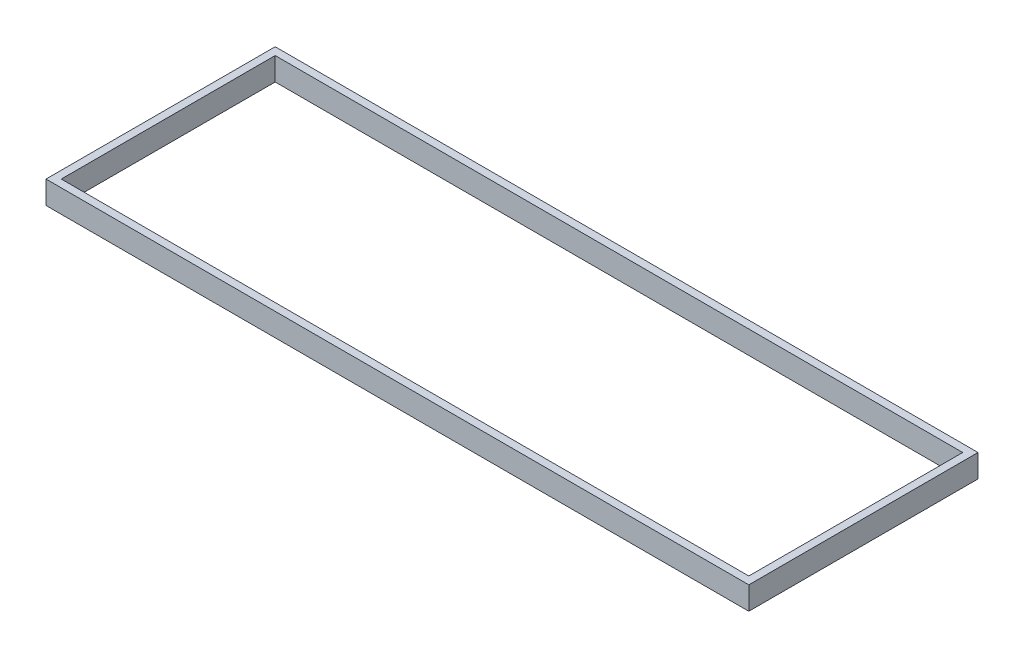
ISO-10303-21;
HEADER;
FILE_DESCRIPTION(('STEP AP214'),'2;1');
FILE_NAME('part.step','',(''),(''),'','','');
FILE_SCHEMA(('AUTOMOTIVE_DESIGN { 1 0 10303 214 1 1 1 1 }'));
ENDSEC;
DATA;
#1=APPLICATION_CONTEXT('core data for automotive mechanical design processes');
#2=APPLICATION_PROTOCOL_DEFINITION('international standard','automotive_design',2000,#1);
#3=PRODUCT_CONTEXT('',#1,'mechanical');
#4=PRODUCT('Part','Part','',(#3));
#5=PRODUCT_RELATED_PRODUCT_CATEGORY('part','',(#4));
#6=PRODUCT_DEFINITION_FORMATION('','',#4);
#7=PRODUCT_DEFINITION_CONTEXT('part definition',#1,'design');
#8=PRODUCT_DEFINITION('design','',#6,#7);
#9=PRODUCT_DEFINITION_SHAPE('','',#8);
#10=(LENGTH_UNIT() NAMED_UNIT(*) SI_UNIT(.MILLI.,.METRE.));
#11=(NAMED_UNIT(*) PLANE_ANGLE_UNIT() SI_UNIT($,.RADIAN.));
#12=(NAMED_UNIT(*) SI_UNIT($,.STERADIAN.) SOLID_ANGLE_UNIT());
#13=UNCERTAINTY_MEASURE_WITH_UNIT(LENGTH_MEASURE(1.E-05),#10,'distance_accuracy_value','');
#14=(GEOMETRIC_REPRESENTATION_CONTEXT(3) GLOBAL_UNCERTAINTY_ASSIGNED_CONTEXT((#13)) GLOBAL_UNIT_ASSIGNED_CONTEXT((#10,
#11,#12)) REPRESENTATION_CONTEXT('',''));
#15=CARTESIAN_POINT('',(0.,0.,0.));
#16=DIRECTION('',(0.,0.,1.));
#17=DIRECTION('',(1.,0.,0.));
#18=AXIS2_PLACEMENT_3D('',#15,#16,#17);
#19=CARTESIAN_POINT('',(0.,3.,0.));
#20=DIRECTION('',(0.,1.,0.));
#21=DIRECTION('',(0.,0.,1.));
#22=AXIS2_PLACEMENT_3D('',#19,#20,#21);
#23=PLANE('',#22);
#24=DIRECTION('',(0.,0.,-1.));
#25=VECTOR('',#24,1.);
#26=CARTESIAN_POINT('',(46.,3.,-14.));
#27=LINE('',#26,#25);
#28=CARTESIAN_POINT('',(46.,3.,15.));
#29=VERTEX_POINT('',#28);
#30=CARTESIAN_POINT('',(46.,3.,-15.));
#31=VERTEX_POINT('',#30);
#32=EDGE_CURVE('E177',#29,#31,#27,.T.);
#33=ORIENTED_EDGE('',*,*,#32,.T.);
#34=DIRECTION('',(-1.,0.,0.));
#35=VECTOR('',#34,1.);
#36=CARTESIAN_POINT('',(-45.,3.,-15.));
#37=LINE('',#36,#35);
#38=CARTESIAN_POINT('',(-46.,3.,-15.));
#39=VERTEX_POINT('',#38);
#40=EDGE_CURVE('E181',#31,#39,#37,.T.);
#41=ORIENTED_EDGE('',*,*,#40,.T.);
#42=DIRECTION('',(0.,0.,1.));
#43=VECTOR('',#42,1.);
#44=CARTESIAN_POINT('',(-46.,3.,-14.));
#45=LINE('',#44,#43);
#46=CARTESIAN_POINT('',(-46.,3.,15.));
#47=VERTEX_POINT('',#46);
#48=EDGE_CURVE('E185',#39,#47,#45,.T.);
#49=ORIENTED_EDGE('',*,*,#48,.T.);
#50=DIRECTION('',(1.,0.,0.));
#51=VECTOR('',#50,1.);
#52=CARTESIAN_POINT('',(-45.,3.,15.));
#53=LINE('',#52,#51);
#54=EDGE_CURVE('E188',#47,#29,#53,.T.);
#55=ORIENTED_EDGE('',*,*,#54,.T.);
#56=EDGE_LOOP('',(#33,#41,#49,#55));
#57=FACE_BOUND('',#56,.T.);
#58=DIRECTION('',(-1.,0.,0.));
#59=VECTOR('',#58,1.);
#60=CARTESIAN_POINT('',(-45.,3.,-14.));
#61=LINE('',#60,#59);
#62=CARTESIAN_POINT('',(45.,3.,-14.));
#63=VERTEX_POINT('',#62);
#64=CARTESIAN_POINT('',(-45.,3.,-14.));
#65=VERTEX_POINT('',#64);
#66=EDGE_CURVE('E138',#63,#65,#61,.T.);
#67=ORIENTED_EDGE('',*,*,#66,.F.);
#68=DIRECTION('',(0.,0.,-1.));
#69=VECTOR('',#68,1.);
#70=CARTESIAN_POINT('',(45.,3.,-14.));
#71=LINE('',#70,#69);
#72=CARTESIAN_POINT('',(45.,3.,14.));
#73=VERTEX_POINT('',#72);
#74=EDGE_CURVE('E129',#73,#63,#71,.T.);
#75=ORIENTED_EDGE('',*,*,#74,.F.);
#76=DIRECTION('',(1.,0.,0.));
#77=VECTOR('',#76,1.);
#78=CARTESIAN_POINT('',(-45.,3.,14.));
#79=LINE('',#78,#77);
#80=CARTESIAN_POINT('',(-45.,3.,14.));
#81=VERTEX_POINT('',#80);
#82=EDGE_CURVE('E155',#81,#73,#79,.T.);
#83=ORIENTED_EDGE('',*,*,#82,.F.);
#84=DIRECTION('',(0.,0.,1.));
#85=VECTOR('',#84,1.);
#86=CARTESIAN_POINT('',(-45.,3.,-14.));
#87=LINE('',#86,#85);
#88=EDGE_CURVE('E151',#65,#81,#87,.T.);
#89=ORIENTED_EDGE('',*,*,#88,.F.);
#90=EDGE_LOOP('',(#67,#75,#83,#89));
#91=FACE_BOUND('',#90,.T.);
#92=ADVANCED_FACE('F63',(#57,#91),#23,.T.);
#93=CARTESIAN_POINT('',(0.,0.,0.));
#94=DIRECTION('',(0.,1.,0.));
#95=DIRECTION('',(0.,0.,1.));
#96=AXIS2_PLACEMENT_3D('',#93,#94,#95);
#97=PLANE('',#96);
#98=DIRECTION('',(0.,0.,-1.));
#99=VECTOR('',#98,1.);
#100=CARTESIAN_POINT('',(46.,0.,-14.));
#101=LINE('',#100,#99);
#102=CARTESIAN_POINT('',(46.,0.,15.));
#103=VERTEX_POINT('',#102);
#104=CARTESIAN_POINT('',(46.,0.,-15.));
#105=VERTEX_POINT('',#104);
#106=EDGE_CURVE('E147',#103,#105,#101,.T.);
#107=ORIENTED_EDGE('',*,*,#106,.F.);
#108=DIRECTION('',(1.,0.,0.));
#109=VECTOR('',#108,1.);
#110=CARTESIAN_POINT('',(-45.,0.,15.));
#111=LINE('',#110,#109);
#112=CARTESIAN_POINT('',(-46.,0.,15.));
#113=VERTEX_POINT('',#112);
#114=EDGE_CURVE('E182',#113,#103,#111,.T.);
#115=ORIENTED_EDGE('',*,*,#114,.F.);
#116=DIRECTION('',(0.,0.,1.));
#117=VECTOR('',#116,1.);
#118=CARTESIAN_POINT('',(-46.,0.,-14.));
#119=LINE('',#118,#117);
#120=CARTESIAN_POINT('',(-46.,0.,-15.));
#121=VERTEX_POINT('',#120);
#122=EDGE_CURVE('E198',#121,#113,#119,.T.);
#123=ORIENTED_EDGE('',*,*,#122,.F.);
#124=DIRECTION('',(-1.,0.,0.));
#125=VECTOR('',#124,1.);
#126=CARTESIAN_POINT('',(-45.,0.,-15.));
#127=LINE('',#126,#125);
#128=EDGE_CURVE('E195',#105,#121,#127,.T.);
#129=ORIENTED_EDGE('',*,*,#128,.F.);
#130=EDGE_LOOP('',(#107,#115,#123,#129));
#131=FACE_BOUND('',#130,.T.);
#132=DIRECTION('',(0.,0.,-1.));
#133=VECTOR('',#132,1.);
#134=CARTESIAN_POINT('',(45.,0.,-14.));
#135=LINE('',#134,#133);
#136=CARTESIAN_POINT('',(45.,0.,14.));
#137=VERTEX_POINT('',#136);
#138=CARTESIAN_POINT('',(45.,0.,-14.));
#139=VERTEX_POINT('',#138);
#140=EDGE_CURVE('E87',#137,#139,#135,.T.);
#141=ORIENTED_EDGE('',*,*,#140,.T.);
#142=DIRECTION('',(-1.,0.,0.));
#143=VECTOR('',#142,1.);
#144=CARTESIAN_POINT('',(-45.,0.,-14.));
#145=LINE('',#144,#143);
#146=CARTESIAN_POINT('',(-45.,0.,-14.));
#147=VERTEX_POINT('',#146);
#148=EDGE_CURVE('E145',#139,#147,#145,.T.);
#149=ORIENTED_EDGE('',*,*,#148,.T.);
#150=DIRECTION('',(0.,0.,1.));
#151=VECTOR('',#150,1.);
#152=CARTESIAN_POINT('',(-45.,0.,-14.));
#153=LINE('',#152,#151);
#154=CARTESIAN_POINT('',(-45.,0.,14.));
#155=VERTEX_POINT('',#154);
#156=EDGE_CURVE('E164',#147,#155,#153,.T.);
#157=ORIENTED_EDGE('',*,*,#156,.T.);
#158=DIRECTION('',(1.,0.,0.));
#159=VECTOR('',#158,1.);
#160=CARTESIAN_POINT('',(-45.,0.,14.));
#161=LINE('',#160,#159);
#162=EDGE_CURVE('E139',#155,#137,#161,.T.);
#163=ORIENTED_EDGE('',*,*,#162,.T.);
#164=EDGE_LOOP('',(#141,#149,#157,#163));
#165=FACE_BOUND('',#164,.T.);
#166=ADVANCED_FACE('F221',(#131,#165),#97,.F.);
#167=CARTESIAN_POINT('',(46.,3.,-14.));
#168=DIRECTION('',(-1.,0.,0.));
#169=DIRECTION('',(0.,0.,1.));
#170=AXIS2_PLACEMENT_3D('',#167,#168,#169);
#171=PLANE('',#170);
#172=ORIENTED_EDGE('',*,*,#106,.T.);
#173=DIRECTION('',(0.,-1.,0.));
#174=VECTOR('',#173,1.);
#175=CARTESIAN_POINT('',(46.,3.,-15.));
#176=LINE('',#175,#174);
#177=EDGE_CURVE('E12',#31,#105,#176,.T.);
#178=ORIENTED_EDGE('',*,*,#177,.F.);
#179=ORIENTED_EDGE('',*,*,#32,.F.);
#180=DIRECTION('',(0.,-1.,0.));
#181=VECTOR('',#180,1.);
#182=CARTESIAN_POINT('',(46.,3.,15.));
#183=LINE('',#182,#181);
#184=EDGE_CURVE('E191',#29,#103,#183,.T.);
#185=ORIENTED_EDGE('',*,*,#184,.T.);
#186=EDGE_LOOP('',(#172,#178,#179,#185));
#187=FACE_BOUND('',#186,.T.);
#188=ADVANCED_FACE('F65',(#187),#171,.F.);
#189=CARTESIAN_POINT('',(-45.,3.,-15.));
#190=DIRECTION('',(0.,0.,1.));
#191=DIRECTION('',(1.,0.,0.));
#192=AXIS2_PLACEMENT_3D('',#189,#190,#191);
#193=PLANE('',#192);
#194=ORIENTED_EDGE('',*,*,#128,.T.);
#195=DIRECTION('',(0.,-1.,0.));
#196=VECTOR('',#195,1.);
#197=CARTESIAN_POINT('',(-46.,3.,-15.));
#198=LINE('',#197,#196);
#199=EDGE_CURVE('E72',#39,#121,#198,.T.);
#200=ORIENTED_EDGE('',*,*,#199,.F.);
#201=ORIENTED_EDGE('',*,*,#40,.F.);
#202=ORIENTED_EDGE('',*,*,#177,.T.);
#203=EDGE_LOOP('',(#194,#200,#201,#202));
#204=FACE_BOUND('',#203,.T.);
#205=ADVANCED_FACE('F231',(#204),#193,.F.);
#206=CARTESIAN_POINT('',(-46.,3.,-14.));
#207=DIRECTION('',(1.,0.,0.));
#208=DIRECTION('',(0.,0.,-1.));
#209=AXIS2_PLACEMENT_3D('',#206,#207,#208);
#210=PLANE('',#209);
#211=ORIENTED_EDGE('',*,*,#122,.T.);
#212=DIRECTION('',(0.,-1.,0.));
#213=VECTOR('',#212,1.);
#214=CARTESIAN_POINT('',(-46.,3.,15.));
#215=LINE('',#214,#213);
#216=EDGE_CURVE('E206',#47,#113,#215,.T.);
#217=ORIENTED_EDGE('',*,*,#216,.F.);
#218=ORIENTED_EDGE('',*,*,#48,.F.);
#219=ORIENTED_EDGE('',*,*,#199,.T.);
#220=EDGE_LOOP('',(#211,#217,#218,#219));
#221=FACE_BOUND('',#220,.T.);
#222=ADVANCED_FACE('F215',(#221),#210,.F.);
#223=CARTESIAN_POINT('',(-45.,3.,15.));
#224=DIRECTION('',(0.,0.,-1.));
#225=DIRECTION('',(-1.,0.,0.));
#226=AXIS2_PLACEMENT_3D('',#223,#224,#225);
#227=PLANE('',#226);
#228=ORIENTED_EDGE('',*,*,#114,.T.);
#229=ORIENTED_EDGE('',*,*,#184,.F.);
#230=ORIENTED_EDGE('',*,*,#54,.F.);
#231=ORIENTED_EDGE('',*,*,#216,.T.);
#232=EDGE_LOOP('',(#228,#229,#230,#231));
#233=FACE_BOUND('',#232,.T.);
#234=ADVANCED_FACE('F225',(#233),#227,.F.);
#235=CARTESIAN_POINT('',(45.,3.,-14.));
#236=DIRECTION('',(-1.,0.,0.));
#237=DIRECTION('',(0.,0.,1.));
#238=AXIS2_PLACEMENT_3D('',#235,#236,#237);
#239=PLANE('',#238);
#240=ORIENTED_EDGE('',*,*,#140,.F.);
#241=DIRECTION('',(0.,-1.,0.));
#242=VECTOR('',#241,1.);
#243=CARTESIAN_POINT('',(45.,3.,14.));
#244=LINE('',#243,#242);
#245=EDGE_CURVE('E133',#73,#137,#244,.T.);
#246=ORIENTED_EDGE('',*,*,#245,.F.);
#247=ORIENTED_EDGE('',*,*,#74,.T.);
#248=DIRECTION('',(0.,-1.,0.));
#249=VECTOR('',#248,1.);
#250=CARTESIAN_POINT('',(45.,3.,-14.));
#251=LINE('',#250,#249);
#252=EDGE_CURVE('E132',#63,#139,#251,.T.);
#253=ORIENTED_EDGE('',*,*,#252,.T.);
#254=EDGE_LOOP('',(#240,#246,#247,#253));
#255=FACE_BOUND('',#254,.T.);
#256=ADVANCED_FACE('F131',(#255),#239,.T.);
#257=CARTESIAN_POINT('',(-45.,3.,-14.));
#258=DIRECTION('',(0.,0.,1.));
#259=DIRECTION('',(1.,0.,0.));
#260=AXIS2_PLACEMENT_3D('',#257,#258,#259);
#261=PLANE('',#260);
#262=ORIENTED_EDGE('',*,*,#148,.F.);
#263=ORIENTED_EDGE('',*,*,#252,.F.);
#264=ORIENTED_EDGE('',*,*,#66,.T.);
#265=DIRECTION('',(0.,-1.,0.));
#266=VECTOR('',#265,1.);
#267=CARTESIAN_POINT('',(-45.,3.,-14.));
#268=LINE('',#267,#266);
#269=EDGE_CURVE('E148',#65,#147,#268,.T.);
#270=ORIENTED_EDGE('',*,*,#269,.T.);
#271=EDGE_LOOP('',(#262,#263,#264,#270));
#272=FACE_BOUND('',#271,.T.);
#273=ADVANCED_FACE('F142',(#272),#261,.T.);
#274=CARTESIAN_POINT('',(-45.,3.,-14.));
#275=DIRECTION('',(1.,0.,0.));
#276=DIRECTION('',(0.,0.,-1.));
#277=AXIS2_PLACEMENT_3D('',#274,#275,#276);
#278=PLANE('',#277);
#279=ORIENTED_EDGE('',*,*,#156,.F.);
#280=ORIENTED_EDGE('',*,*,#269,.F.);
#281=ORIENTED_EDGE('',*,*,#88,.T.);
#282=DIRECTION('',(0.,-1.,0.));
#283=VECTOR('',#282,1.);
#284=CARTESIAN_POINT('',(-45.,3.,14.));
#285=LINE('',#284,#283);
#286=EDGE_CURVE('E79',#81,#155,#285,.T.);
#287=ORIENTED_EDGE('',*,*,#286,.T.);
#288=EDGE_LOOP('',(#279,#280,#281,#287));
#289=FACE_BOUND('',#288,.T.);
#290=ADVANCED_FACE('F254',(#289),#278,.T.);
#291=CARTESIAN_POINT('',(-45.,3.,14.));
#292=DIRECTION('',(0.,0.,-1.));
#293=DIRECTION('',(-1.,0.,0.));
#294=AXIS2_PLACEMENT_3D('',#291,#292,#293);
#295=PLANE('',#294);
#296=ORIENTED_EDGE('',*,*,#162,.F.);
#297=ORIENTED_EDGE('',*,*,#286,.F.);
#298=ORIENTED_EDGE('',*,*,#82,.T.);
#299=ORIENTED_EDGE('',*,*,#245,.T.);
#300=EDGE_LOOP('',(#296,#297,#298,#299));
#301=FACE_BOUND('',#300,.T.);
#302=ADVANCED_FACE('F258',(#301),#295,.T.);
#303=CLOSED_SHELL('',(#92,#166,#188,#205,#222,#234,#256,#273,#290,#302));
#304=MANIFOLD_SOLID_BREP('B2',#303);
#305=ADVANCED_BREP_SHAPE_REPRESENTATION('',(#18,#304),#14);
#306=SHAPE_DEFINITION_REPRESENTATION(#9,#305);
ENDSEC;
END-ISO-10303-21;
